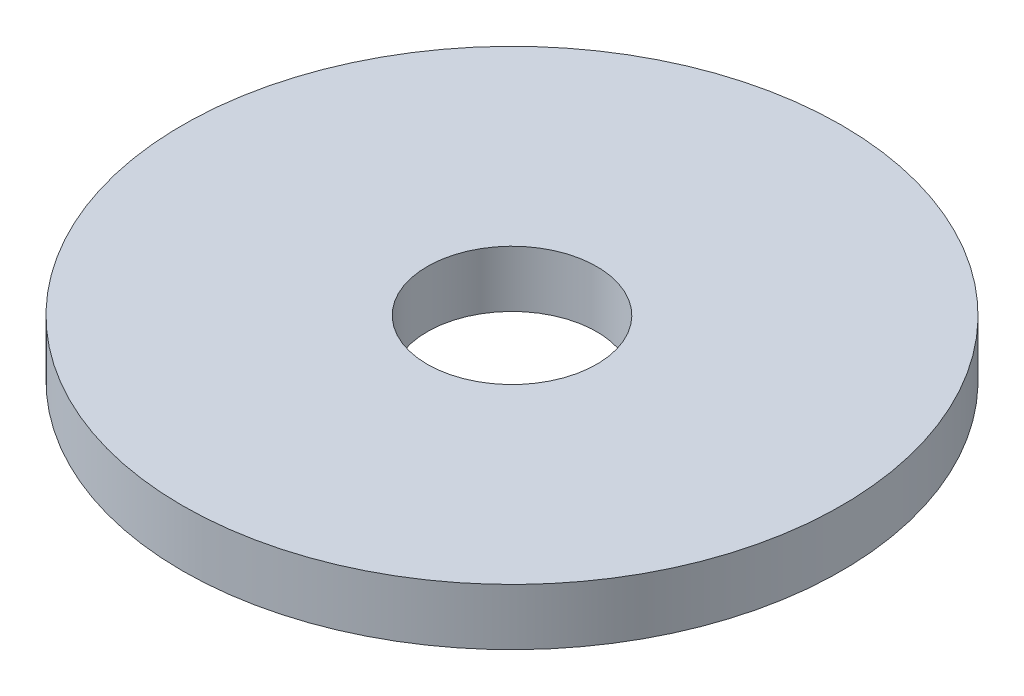
ISO-10303-21;
HEADER;
FILE_DESCRIPTION(('STEP AP214'),'2;1');
FILE_NAME('part.step','',(''),(''),'','','');
FILE_SCHEMA(('AUTOMOTIVE_DESIGN { 1 0 10303 214 1 1 1 1 }'));
ENDSEC;
DATA;
#1=APPLICATION_CONTEXT('core data for automotive mechanical design processes');
#2=APPLICATION_PROTOCOL_DEFINITION('international standard','automotive_design',2000,#1);
#3=PRODUCT_CONTEXT('',#1,'mechanical');
#4=PRODUCT('Part','Part','',(#3));
#5=PRODUCT_RELATED_PRODUCT_CATEGORY('part','',(#4));
#6=PRODUCT_DEFINITION_FORMATION('','',#4);
#7=PRODUCT_DEFINITION_CONTEXT('part definition',#1,'design');
#8=PRODUCT_DEFINITION('design','',#6,#7);
#9=PRODUCT_DEFINITION_SHAPE('','',#8);
#10=(LENGTH_UNIT() NAMED_UNIT(*) SI_UNIT(.MILLI.,.METRE.));
#11=(NAMED_UNIT(*) PLANE_ANGLE_UNIT() SI_UNIT($,.RADIAN.));
#12=(NAMED_UNIT(*) SI_UNIT($,.STERADIAN.) SOLID_ANGLE_UNIT());
#13=UNCERTAINTY_MEASURE_WITH_UNIT(LENGTH_MEASURE(1.E-05),#10,'distance_accuracy_value','');
#14=(GEOMETRIC_REPRESENTATION_CONTEXT(3) GLOBAL_UNCERTAINTY_ASSIGNED_CONTEXT((#13)) GLOBAL_UNIT_ASSIGNED_CONTEXT((#10,
#11,#12)) REPRESENTATION_CONTEXT('',''));
#15=CARTESIAN_POINT('',(0.,0.,0.));
#16=DIRECTION('',(0.,0.,1.));
#17=DIRECTION('',(1.,0.,0.));
#18=AXIS2_PLACEMENT_3D('',#15,#16,#17);
#19=CARTESIAN_POINT('',(0.,2.96830985915493,0.));
#20=DIRECTION('',(0.,1.,0.));
#21=DIRECTION('',(0.,0.,1.));
#22=AXIS2_PLACEMENT_3D('',#19,#20,#21);
#23=CYLINDRICAL_SURFACE('',#22,4.5);
#24=CARTESIAN_POINT('',(0.,0.,0.));
#25=DIRECTION('',(0.,1.,0.));
#26=DIRECTION('',(0.,0.,1.));
#27=AXIS2_PLACEMENT_3D('',#24,#25,#26);
#28=CIRCLE('',#27,4.5);
#29=CARTESIAN_POINT('',(0.,0.,4.5));
#30=VERTEX_POINT('',#29);
#31=EDGE_CURVE('E10',#30,#30,#28,.T.);
#32=ORIENTED_EDGE('',*,*,#31,.T.);
#33=EDGE_LOOP('',(#32));
#34=FACE_BOUND('',#33,.T.);
#35=CARTESIAN_POINT('',(0.,-3.,0.));
#36=DIRECTION('',(0.,1.,0.));
#37=DIRECTION('',(0.,0.,1.));
#38=AXIS2_PLACEMENT_3D('',#35,#36,#37);
#39=CIRCLE('',#38,4.5);
#40=CARTESIAN_POINT('',(0.,-3.,4.5));
#41=VERTEX_POINT('',#40);
#42=EDGE_CURVE('E54',#41,#41,#39,.T.);
#43=ORIENTED_EDGE('',*,*,#42,.F.);
#44=EDGE_LOOP('',(#43));
#45=FACE_BOUND('',#44,.T.);
#46=ADVANCED_FACE('F37',(#34,#45),#23,.F.);
#47=CARTESIAN_POINT('',(-17.5,0.,0.));
#48=DIRECTION('',(0.,1.,0.));
#49=DIRECTION('',(0.,0.,1.));
#50=AXIS2_PLACEMENT_3D('',#47,#48,#49);
#51=PLANE('',#50);
#52=CARTESIAN_POINT('',(0.,0.,0.));
#53=DIRECTION('',(0.,1.,0.));
#54=DIRECTION('',(0.,0.,1.));
#55=AXIS2_PLACEMENT_3D('',#52,#53,#54);
#56=CIRCLE('',#55,17.5);
#57=CARTESIAN_POINT('',(0.,0.,17.5));
#58=VERTEX_POINT('',#57);
#59=EDGE_CURVE('E44',#58,#58,#56,.T.);
#60=ORIENTED_EDGE('',*,*,#59,.T.);
#61=EDGE_LOOP('',(#60));
#62=FACE_BOUND('',#61,.T.);
#63=ORIENTED_EDGE('',*,*,#31,.F.);
#64=EDGE_LOOP('',(#63));
#65=FACE_BOUND('',#64,.T.);
#66=ADVANCED_FACE('F65',(#62,#65),#51,.T.);
#67=CARTESIAN_POINT('',(0.,2.96830985915493,0.));
#68=DIRECTION('',(0.,1.,0.));
#69=DIRECTION('',(0.,0.,1.));
#70=AXIS2_PLACEMENT_3D('',#67,#68,#69);
#71=CYLINDRICAL_SURFACE('',#70,17.5);
#72=CARTESIAN_POINT('',(0.,-3.,0.));
#73=DIRECTION('',(0.,1.,0.));
#74=DIRECTION('',(0.,0.,1.));
#75=AXIS2_PLACEMENT_3D('',#72,#73,#74);
#76=CIRCLE('',#75,17.5);
#77=CARTESIAN_POINT('',(0.,-3.,17.5));
#78=VERTEX_POINT('',#77);
#79=EDGE_CURVE('E49',#78,#78,#76,.T.);
#80=ORIENTED_EDGE('',*,*,#79,.T.);
#81=EDGE_LOOP('',(#80));
#82=FACE_BOUND('',#81,.T.);
#83=ORIENTED_EDGE('',*,*,#59,.F.);
#84=EDGE_LOOP('',(#83));
#85=FACE_BOUND('',#84,.T.);
#86=ADVANCED_FACE('F69',(#82,#85),#71,.T.);
#87=CARTESIAN_POINT('',(-17.5,-3.,0.));
#88=DIRECTION('',(0.,-1.,0.));
#89=DIRECTION('',(0.,0.,-1.));
#90=AXIS2_PLACEMENT_3D('',#87,#88,#89);
#91=PLANE('',#90);
#92=ORIENTED_EDGE('',*,*,#42,.T.);
#93=EDGE_LOOP('',(#92));
#94=FACE_BOUND('',#93,.T.);
#95=ORIENTED_EDGE('',*,*,#79,.F.);
#96=EDGE_LOOP('',(#95));
#97=FACE_BOUND('',#96,.T.);
#98=ADVANCED_FACE('F61',(#94,#97),#91,.T.);
#99=CLOSED_SHELL('',(#46,#66,#86,#98));
#100=MANIFOLD_SOLID_BREP('B2',#99);
#101=ADVANCED_BREP_SHAPE_REPRESENTATION('',(#18,#100),#14);
#102=SHAPE_DEFINITION_REPRESENTATION(#9,#101);
ENDSEC;
END-ISO-10303-21;
